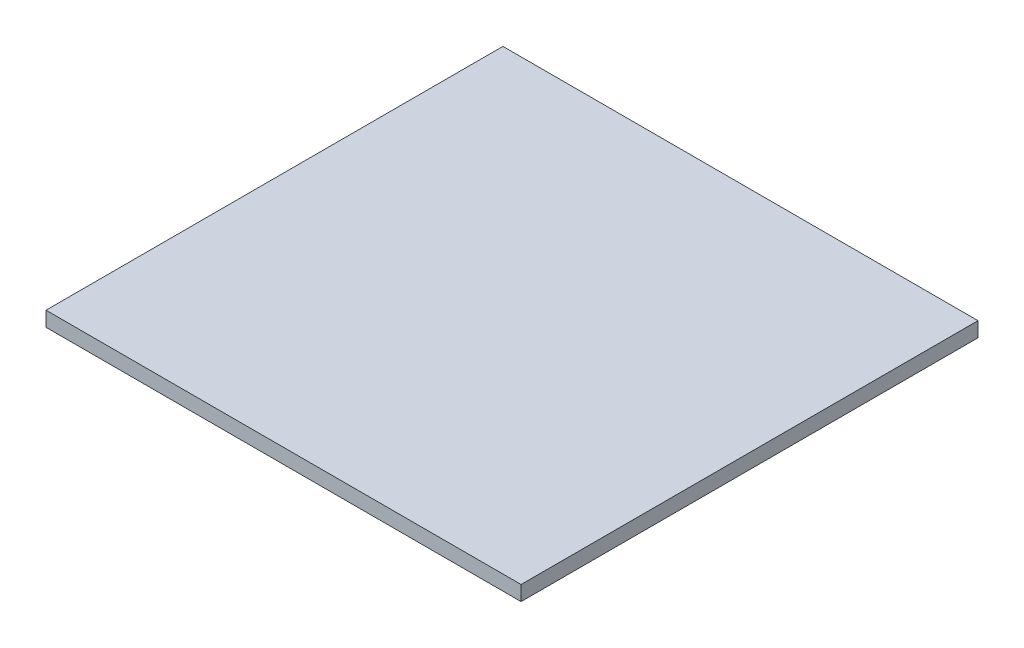
ISO-10303-21;
HEADER;
FILE_DESCRIPTION(('STEP AP214'),'2;1');
FILE_NAME('part.step','',(''),(''),'','','');
FILE_SCHEMA(('AUTOMOTIVE_DESIGN { 1 0 10303 214 1 1 1 1 }'));
ENDSEC;
DATA;
#1=APPLICATION_CONTEXT('core data for automotive mechanical design processes');
#2=APPLICATION_PROTOCOL_DEFINITION('international standard','automotive_design',2000,#1);
#3=PRODUCT_CONTEXT('',#1,'mechanical');
#4=PRODUCT('Part','Part','',(#3));
#5=PRODUCT_RELATED_PRODUCT_CATEGORY('part','',(#4));
#6=PRODUCT_DEFINITION_FORMATION('','',#4);
#7=PRODUCT_DEFINITION_CONTEXT('part definition',#1,'design');
#8=PRODUCT_DEFINITION('design','',#6,#7);
#9=PRODUCT_DEFINITION_SHAPE('','',#8);
#10=(LENGTH_UNIT() NAMED_UNIT(*) SI_UNIT(.MILLI.,.METRE.));
#11=(NAMED_UNIT(*) PLANE_ANGLE_UNIT() SI_UNIT($,.RADIAN.));
#12=(NAMED_UNIT(*) SI_UNIT($,.STERADIAN.) SOLID_ANGLE_UNIT());
#13=UNCERTAINTY_MEASURE_WITH_UNIT(LENGTH_MEASURE(1.E-05),#10,'distance_accuracy_value','');
#14=(GEOMETRIC_REPRESENTATION_CONTEXT(3) GLOBAL_UNCERTAINTY_ASSIGNED_CONTEXT((#13)) GLOBAL_UNIT_ASSIGNED_CONTEXT((#10,
#11,#12)) REPRESENTATION_CONTEXT('',''));
#15=CARTESIAN_POINT('',(0.,0.,0.));
#16=DIRECTION('',(0.,0.,1.));
#17=DIRECTION('',(1.,0.,0.));
#18=AXIS2_PLACEMENT_3D('',#15,#16,#17);
#19=CARTESIAN_POINT('',(-288.,18.,277.));
#20=DIRECTION('',(1.,0.,0.));
#21=DIRECTION('',(0.,0.,-1.));
#22=AXIS2_PLACEMENT_3D('',#19,#20,#21);
#23=PLANE('',#22);
#24=DIRECTION('',(0.,0.,1.));
#25=VECTOR('',#24,1.);
#26=CARTESIAN_POINT('',(-288.,0.,277.));
#27=LINE('',#26,#25);
#28=CARTESIAN_POINT('',(-288.,0.,-277.));
#29=VERTEX_POINT('',#28);
#30=CARTESIAN_POINT('',(-288.,0.,277.));
#31=VERTEX_POINT('',#30);
#32=EDGE_CURVE('E98',#29,#31,#27,.T.);
#33=ORIENTED_EDGE('',*,*,#32,.T.);
#34=DIRECTION('',(0.,-1.,0.));
#35=VECTOR('',#34,1.);
#36=CARTESIAN_POINT('',(-288.,18.,277.));
#37=LINE('',#36,#35);
#38=CARTESIAN_POINT('',(-288.,18.,277.));
#39=VERTEX_POINT('',#38);
#40=EDGE_CURVE('E11',#39,#31,#37,.T.);
#41=ORIENTED_EDGE('',*,*,#40,.F.);
#42=DIRECTION('',(0.,0.,1.));
#43=VECTOR('',#42,1.);
#44=CARTESIAN_POINT('',(-288.,18.,277.));
#45=LINE('',#44,#43);
#46=CARTESIAN_POINT('',(-288.,18.,-277.));
#47=VERTEX_POINT('',#46);
#48=EDGE_CURVE('E86',#47,#39,#45,.T.);
#49=ORIENTED_EDGE('',*,*,#48,.F.);
#50=DIRECTION('',(0.,-1.,0.));
#51=VECTOR('',#50,1.);
#52=CARTESIAN_POINT('',(-288.,18.,-277.));
#53=LINE('',#52,#51);
#54=EDGE_CURVE('E94',#47,#29,#53,.T.);
#55=ORIENTED_EDGE('',*,*,#54,.T.);
#56=EDGE_LOOP('',(#33,#41,#49,#55));
#57=FACE_BOUND('',#56,.T.);
#58=ADVANCED_FACE('F35',(#57),#23,.F.);
#59=CARTESIAN_POINT('',(288.,18.,277.));
#60=DIRECTION('',(0.,0.,-1.));
#61=DIRECTION('',(-1.,0.,0.));
#62=AXIS2_PLACEMENT_3D('',#59,#60,#61);
#63=PLANE('',#62);
#64=DIRECTION('',(1.,0.,0.));
#65=VECTOR('',#64,1.);
#66=CARTESIAN_POINT('',(288.,0.,277.));
#67=LINE('',#66,#65);
#68=CARTESIAN_POINT('',(288.,0.,277.));
#69=VERTEX_POINT('',#68);
#70=EDGE_CURVE('E90',#31,#69,#67,.T.);
#71=ORIENTED_EDGE('',*,*,#70,.T.);
#72=DIRECTION('',(0.,-1.,0.));
#73=VECTOR('',#72,1.);
#74=CARTESIAN_POINT('',(288.,18.,277.));
#75=LINE('',#74,#73);
#76=CARTESIAN_POINT('',(288.,18.,277.));
#77=VERTEX_POINT('',#76);
#78=EDGE_CURVE('E43',#77,#69,#75,.T.);
#79=ORIENTED_EDGE('',*,*,#78,.F.);
#80=DIRECTION('',(1.,0.,0.));
#81=VECTOR('',#80,1.);
#82=CARTESIAN_POINT('',(288.,18.,277.));
#83=LINE('',#82,#81);
#84=EDGE_CURVE('E81',#39,#77,#83,.T.);
#85=ORIENTED_EDGE('',*,*,#84,.F.);
#86=ORIENTED_EDGE('',*,*,#40,.T.);
#87=EDGE_LOOP('',(#71,#79,#85,#86));
#88=FACE_BOUND('',#87,.T.);
#89=ADVANCED_FACE('F89',(#88),#63,.F.);
#90=CARTESIAN_POINT('',(288.,18.,277.));
#91=DIRECTION('',(-1.,0.,0.));
#92=DIRECTION('',(0.,0.,1.));
#93=AXIS2_PLACEMENT_3D('',#90,#91,#92);
#94=PLANE('',#93);
#95=DIRECTION('',(0.,0.,-1.));
#96=VECTOR('',#95,1.);
#97=CARTESIAN_POINT('',(288.,0.,277.));
#98=LINE('',#97,#96);
#99=CARTESIAN_POINT('',(288.,0.,-277.));
#100=VERTEX_POINT('',#99);
#101=EDGE_CURVE('E68',#69,#100,#98,.T.);
#102=ORIENTED_EDGE('',*,*,#101,.T.);
#103=DIRECTION('',(0.,-1.,0.));
#104=VECTOR('',#103,1.);
#105=CARTESIAN_POINT('',(288.,18.,-277.));
#106=LINE('',#105,#104);
#107=CARTESIAN_POINT('',(288.,18.,-277.));
#108=VERTEX_POINT('',#107);
#109=EDGE_CURVE('E91',#108,#100,#106,.T.);
#110=ORIENTED_EDGE('',*,*,#109,.F.);
#111=DIRECTION('',(0.,0.,-1.));
#112=VECTOR('',#111,1.);
#113=CARTESIAN_POINT('',(288.,18.,277.));
#114=LINE('',#113,#112);
#115=EDGE_CURVE('E84',#77,#108,#114,.T.);
#116=ORIENTED_EDGE('',*,*,#115,.F.);
#117=ORIENTED_EDGE('',*,*,#78,.T.);
#118=EDGE_LOOP('',(#102,#110,#116,#117));
#119=FACE_BOUND('',#118,.T.);
#120=ADVANCED_FACE('F92',(#119),#94,.F.);
#121=CARTESIAN_POINT('',(288.,18.,-277.));
#122=DIRECTION('',(0.,0.,1.));
#123=DIRECTION('',(1.,0.,0.));
#124=AXIS2_PLACEMENT_3D('',#121,#122,#123);
#125=PLANE('',#124);
#126=DIRECTION('',(-1.,0.,0.));
#127=VECTOR('',#126,1.);
#128=CARTESIAN_POINT('',(288.,0.,-277.));
#129=LINE('',#128,#127);
#130=EDGE_CURVE('E74',#100,#29,#129,.T.);
#131=ORIENTED_EDGE('',*,*,#130,.T.);
#132=ORIENTED_EDGE('',*,*,#54,.F.);
#133=DIRECTION('',(-1.,0.,0.));
#134=VECTOR('',#133,1.);
#135=CARTESIAN_POINT('',(288.,18.,-277.));
#136=LINE('',#135,#134);
#137=EDGE_CURVE('E51',#108,#47,#136,.T.);
#138=ORIENTED_EDGE('',*,*,#137,.F.);
#139=ORIENTED_EDGE('',*,*,#109,.T.);
#140=EDGE_LOOP('',(#131,#132,#138,#139));
#141=FACE_BOUND('',#140,.T.);
#142=ADVANCED_FACE('F105',(#141),#125,.F.);
#143=CARTESIAN_POINT('',(0.,18.,0.));
#144=DIRECTION('',(0.,1.,0.));
#145=DIRECTION('',(0.,0.,1.));
#146=AXIS2_PLACEMENT_3D('',#143,#144,#145);
#147=PLANE('',#146);
#148=ORIENTED_EDGE('',*,*,#48,.T.);
#149=ORIENTED_EDGE('',*,*,#84,.T.);
#150=ORIENTED_EDGE('',*,*,#115,.T.);
#151=ORIENTED_EDGE('',*,*,#137,.T.);
#152=EDGE_LOOP('',(#148,#149,#150,#151));
#153=FACE_BOUND('',#152,.T.);
#154=ADVANCED_FACE('F82',(#153),#147,.T.);
#155=CARTESIAN_POINT('',(0.,0.,0.));
#156=DIRECTION('',(0.,1.,0.));
#157=DIRECTION('',(0.,0.,1.));
#158=AXIS2_PLACEMENT_3D('',#155,#156,#157);
#159=PLANE('',#158);
#160=ORIENTED_EDGE('',*,*,#32,.F.);
#161=ORIENTED_EDGE('',*,*,#130,.F.);
#162=ORIENTED_EDGE('',*,*,#101,.F.);
#163=ORIENTED_EDGE('',*,*,#70,.F.);
#164=EDGE_LOOP('',(#160,#161,#162,#163));
#165=FACE_BOUND('',#164,.T.);
#166=ADVANCED_FACE('F108',(#165),#159,.F.);
#167=CLOSED_SHELL('',(#58,#89,#120,#142,#154,#166));
#168=MANIFOLD_SOLID_BREP('B2',#167);
#169=ADVANCED_BREP_SHAPE_REPRESENTATION('',(#18,#168),#14);
#170=SHAPE_DEFINITION_REPRESENTATION(#9,#169);
ENDSEC;
END-ISO-10303-21;
